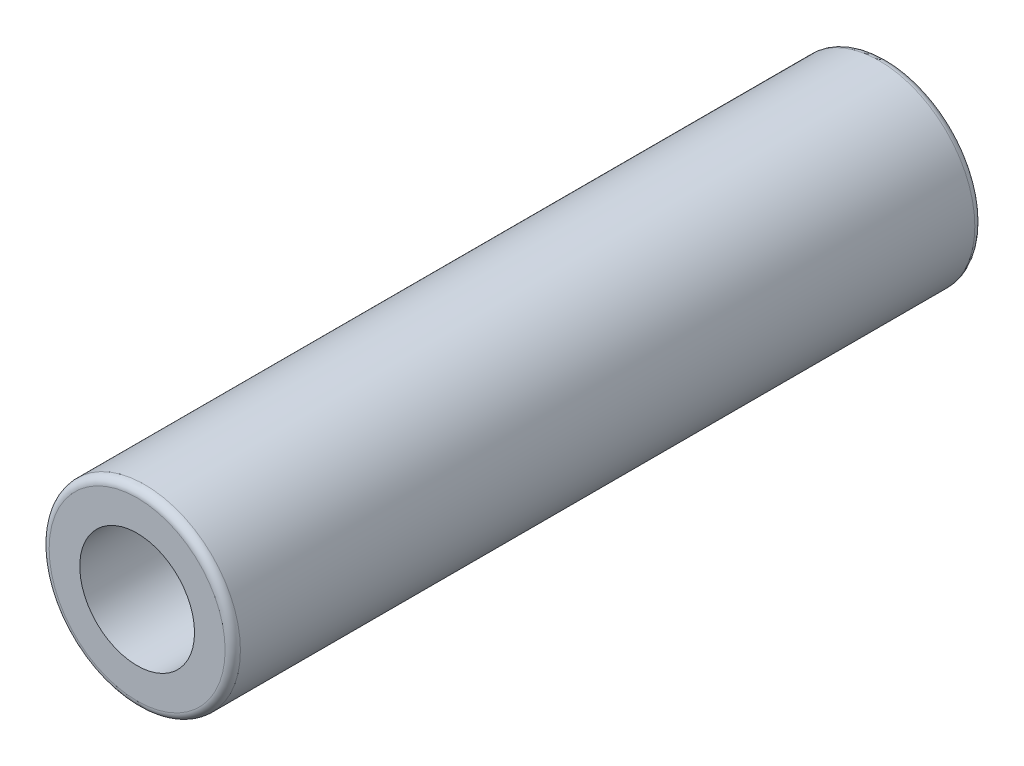
ISO-10303-21;
HEADER;
FILE_DESCRIPTION(('STEP AP214'),'2;1');
FILE_NAME('part.step','',(''),(''),'','','');
FILE_SCHEMA(('AUTOMOTIVE_DESIGN { 1 0 10303 214 1 1 1 1 }'));
ENDSEC;
DATA;
#1=APPLICATION_CONTEXT('core data for automotive mechanical design processes');
#2=APPLICATION_PROTOCOL_DEFINITION('international standard','automotive_design',2000,#1);
#3=PRODUCT_CONTEXT('',#1,'mechanical');
#4=PRODUCT('Part','Part','',(#3));
#5=PRODUCT_RELATED_PRODUCT_CATEGORY('part','',(#4));
#6=PRODUCT_DEFINITION_FORMATION('','',#4);
#7=PRODUCT_DEFINITION_CONTEXT('part definition',#1,'design');
#8=PRODUCT_DEFINITION('design','',#6,#7);
#9=PRODUCT_DEFINITION_SHAPE('','',#8);
#10=(LENGTH_UNIT() NAMED_UNIT(*) SI_UNIT(.MILLI.,.METRE.));
#11=(NAMED_UNIT(*) PLANE_ANGLE_UNIT() SI_UNIT($,.RADIAN.));
#12=(NAMED_UNIT(*) SI_UNIT($,.STERADIAN.) SOLID_ANGLE_UNIT());
#13=UNCERTAINTY_MEASURE_WITH_UNIT(LENGTH_MEASURE(1.E-05),#10,'distance_accuracy_value','');
#14=(GEOMETRIC_REPRESENTATION_CONTEXT(3) GLOBAL_UNCERTAINTY_ASSIGNED_CONTEXT((#13)) GLOBAL_UNIT_ASSIGNED_CONTEXT((#10,
#11,#12)) REPRESENTATION_CONTEXT('',''));
#15=CARTESIAN_POINT('',(0.,0.,0.));
#16=DIRECTION('',(0.,0.,1.));
#17=DIRECTION('',(1.,0.,0.));
#18=AXIS2_PLACEMENT_3D('',#15,#16,#17);
#19=CARTESIAN_POINT('',(0.,0.,24.5));
#20=DIRECTION('',(0.,0.,1.));
#21=DIRECTION('',(1.,0.,0.));
#22=AXIS2_PLACEMENT_3D('',#19,#20,#21);
#23=PLANE('',#22);
#24=CARTESIAN_POINT('',(0.,0.,24.5));
#25=DIRECTION('',(0.,0.,1.));
#26=DIRECTION('',(1.,0.,0.));
#27=AXIS2_PLACEMENT_3D('',#24,#25,#26);
#28=CIRCLE('',#27,5.75);
#29=CARTESIAN_POINT('',(5.75,0.,24.5));
#30=VERTEX_POINT('',#29);
#31=EDGE_CURVE('E11',#30,#30,#28,.T.);
#32=ORIENTED_EDGE('',*,*,#31,.T.);
#33=EDGE_LOOP('',(#32));
#34=FACE_BOUND('',#33,.T.);
#35=CARTESIAN_POINT('',(0.,0.,24.5));
#36=DIRECTION('',(0.,0.,1.));
#37=DIRECTION('',(1.,0.,0.));
#38=AXIS2_PLACEMENT_3D('',#35,#36,#37);
#39=CIRCLE('',#38,3.75);
#40=CARTESIAN_POINT('',(3.75,0.,24.5));
#41=VERTEX_POINT('',#40);
#42=EDGE_CURVE('E63',#41,#41,#39,.T.);
#43=ORIENTED_EDGE('',*,*,#42,.F.);
#44=EDGE_LOOP('',(#43));
#45=FACE_BOUND('',#44,.T.);
#46=ADVANCED_FACE('F43',(#34,#45),#23,.T.);
#47=CARTESIAN_POINT('',(0.,0.,-24.5));
#48=DIRECTION('',(0.,0.,1.));
#49=DIRECTION('',(1.,0.,0.));
#50=AXIS2_PLACEMENT_3D('',#47,#48,#49);
#51=PLANE('',#50);
#52=CARTESIAN_POINT('',(0.,0.,-24.5));
#53=DIRECTION('',(0.,0.,1.));
#54=DIRECTION('',(1.,0.,0.));
#55=AXIS2_PLACEMENT_3D('',#52,#53,#54);
#56=CIRCLE('',#55,5.75);
#57=CARTESIAN_POINT('',(5.75,0.,-24.5));
#58=VERTEX_POINT('',#57);
#59=EDGE_CURVE('E50',#58,#58,#56,.F.);
#60=ORIENTED_EDGE('',*,*,#59,.T.);
#61=EDGE_LOOP('',(#60));
#62=FACE_BOUND('',#61,.T.);
#63=CARTESIAN_POINT('',(0.,0.,-24.5));
#64=DIRECTION('',(0.,0.,1.));
#65=DIRECTION('',(1.,0.,0.));
#66=AXIS2_PLACEMENT_3D('',#63,#64,#65);
#67=CIRCLE('',#66,3.75);
#68=CARTESIAN_POINT('',(3.75,0.,-24.5));
#69=VERTEX_POINT('',#68);
#70=EDGE_CURVE('E64',#69,#69,#67,.T.);
#71=ORIENTED_EDGE('',*,*,#70,.T.);
#72=EDGE_LOOP('',(#71));
#73=FACE_BOUND('',#72,.T.);
#74=ADVANCED_FACE('F74',(#62,#73),#51,.F.);
#75=CARTESIAN_POINT('',(0.,0.,24.5));
#76=DIRECTION('',(0.,0.,-1.));
#77=DIRECTION('',(-1.,0.,0.));
#78=AXIS2_PLACEMENT_3D('',#75,#76,#77);
#79=CYLINDRICAL_SURFACE('',#78,6.25);
#80=CARTESIAN_POINT('',(0.,0.,-24.));
#81=DIRECTION('',(0.,0.,1.));
#82=DIRECTION('',(1.,0.,0.));
#83=AXIS2_PLACEMENT_3D('',#80,#81,#82);
#84=CIRCLE('',#83,6.25);
#85=CARTESIAN_POINT('',(6.25,0.,-24.));
#86=VERTEX_POINT('',#85);
#87=EDGE_CURVE('E54',#86,#86,#84,.T.);
#88=ORIENTED_EDGE('',*,*,#87,.T.);
#89=EDGE_LOOP('',(#88));
#90=FACE_BOUND('',#89,.T.);
#91=CARTESIAN_POINT('',(0.,0.,24.));
#92=DIRECTION('',(0.,0.,1.));
#93=DIRECTION('',(1.,0.,0.));
#94=AXIS2_PLACEMENT_3D('',#91,#92,#93);
#95=CIRCLE('',#94,6.25);
#96=CARTESIAN_POINT('',(6.25,0.,24.));
#97=VERTEX_POINT('',#96);
#98=EDGE_CURVE('E58',#97,#97,#95,.F.);
#99=ORIENTED_EDGE('',*,*,#98,.T.);
#100=EDGE_LOOP('',(#99));
#101=FACE_BOUND('',#100,.T.);
#102=ADVANCED_FACE('F79',(#90,#101),#79,.T.);
#103=CARTESIAN_POINT('',(0.,0.,24.5));
#104=DIRECTION('',(0.,0.,-1.));
#105=DIRECTION('',(-1.,0.,0.));
#106=AXIS2_PLACEMENT_3D('',#103,#104,#105);
#107=CYLINDRICAL_SURFACE('',#106,3.75);
#108=ORIENTED_EDGE('',*,*,#42,.T.);
#109=EDGE_LOOP('',(#108));
#110=FACE_BOUND('',#109,.T.);
#111=ORIENTED_EDGE('',*,*,#70,.F.);
#112=EDGE_LOOP('',(#111));
#113=FACE_BOUND('',#112,.T.);
#114=ADVANCED_FACE('F70',(#110,#113),#107,.F.);
#115=CARTESIAN_POINT('',(0.,0.,-24.));
#116=DIRECTION('',(0.,0.,1.));
#117=DIRECTION('',(1.,0.,0.));
#118=AXIS2_PLACEMENT_3D('',#115,#116,#117);
#119=TOROIDAL_SURFACE('',#118,5.75,0.5);
#120=ORIENTED_EDGE('',*,*,#59,.F.);
#121=EDGE_LOOP('',(#120));
#122=FACE_BOUND('',#121,.T.);
#123=ORIENTED_EDGE('',*,*,#87,.F.);
#124=EDGE_LOOP('',(#123));
#125=FACE_BOUND('',#124,.T.);
#126=ADVANCED_FACE('F85',(#122,#125),#119,.T.);
#127=CARTESIAN_POINT('',(0.,0.,24.));
#128=DIRECTION('',(0.,0.,1.));
#129=DIRECTION('',(1.,0.,0.));
#130=AXIS2_PLACEMENT_3D('',#127,#128,#129);
#131=TOROIDAL_SURFACE('',#130,5.75,0.5);
#132=ORIENTED_EDGE('',*,*,#98,.F.);
#133=EDGE_LOOP('',(#132));
#134=FACE_BOUND('',#133,.T.);
#135=ORIENTED_EDGE('',*,*,#31,.F.);
#136=EDGE_LOOP('',(#135));
#137=FACE_BOUND('',#136,.T.);
#138=ADVANCED_FACE('F45',(#134,#137),#131,.T.);
#139=CLOSED_SHELL('',(#46,#74,#102,#114,#126,#138));
#140=MANIFOLD_SOLID_BREP('B2',#139);
#141=ADVANCED_BREP_SHAPE_REPRESENTATION('',(#18,#140),#14);
#142=SHAPE_DEFINITION_REPRESENTATION(#9,#141);
ENDSEC;
END-ISO-10303-21;
